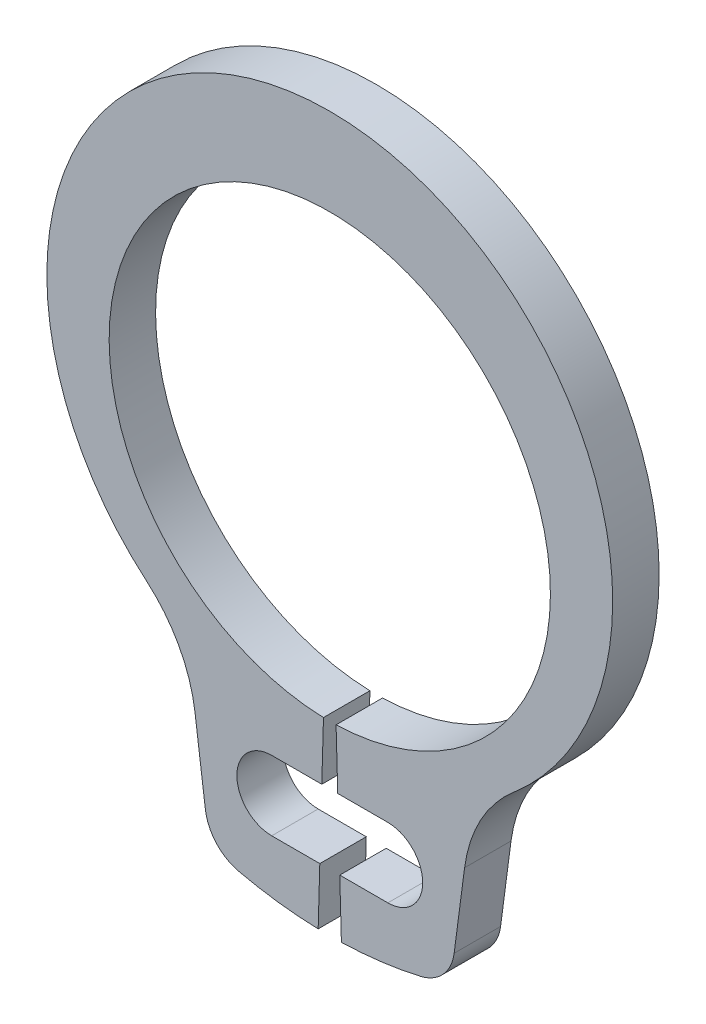
ISO-10303-21;
HEADER;
FILE_DESCRIPTION(('STEP AP214'),'2;1');
FILE_NAME('part.step','',(''),(''),'','','');
FILE_SCHEMA(('AUTOMOTIVE_DESIGN { 1 0 10303 214 1 1 1 1 }'));
ENDSEC;
DATA;
#1=APPLICATION_CONTEXT('core data for automotive mechanical design processes');
#2=APPLICATION_PROTOCOL_DEFINITION('international standard','automotive_design',2000,#1);
#3=PRODUCT_CONTEXT('',#1,'mechanical');
#4=PRODUCT('Part','Part','',(#3));
#5=PRODUCT_RELATED_PRODUCT_CATEGORY('part','',(#4));
#6=PRODUCT_DEFINITION_FORMATION('','',#4);
#7=PRODUCT_DEFINITION_CONTEXT('part definition',#1,'design');
#8=PRODUCT_DEFINITION('design','',#6,#7);
#9=PRODUCT_DEFINITION_SHAPE('','',#8);
#10=(LENGTH_UNIT() NAMED_UNIT(*) SI_UNIT(.MILLI.,.METRE.));
#11=(NAMED_UNIT(*) PLANE_ANGLE_UNIT() SI_UNIT($,.RADIAN.));
#12=(NAMED_UNIT(*) SI_UNIT($,.STERADIAN.) SOLID_ANGLE_UNIT());
#13=UNCERTAINTY_MEASURE_WITH_UNIT(LENGTH_MEASURE(1.E-05),#10,'distance_accuracy_value','');
#14=(GEOMETRIC_REPRESENTATION_CONTEXT(3) GLOBAL_UNCERTAINTY_ASSIGNED_CONTEXT((#13)) GLOBAL_UNIT_ASSIGNED_CONTEXT((#10,
#11,#12)) REPRESENTATION_CONTEXT('',''));
#15=CARTESIAN_POINT('',(0.,0.,0.));
#16=DIRECTION('',(0.,0.,1.));
#17=DIRECTION('',(1.,0.,0.));
#18=AXIS2_PLACEMENT_3D('',#15,#16,#17);
#19=CARTESIAN_POINT('',(-0.108571428571429,-3.7984486629278,-0.8));
#20=DIRECTION('',(0.999591753402051,-0.0285714285714286,0.));
#21=DIRECTION('',(0.0285714285714286,0.999591753402052,0.));
#22=AXIS2_PLACEMENT_3D('',#19,#20,#21);
#23=PLANE('',#22);
#24=DIRECTION('',(0.,0.,1.));
#25=VECTOR('',#24,1.);
#26=CARTESIAN_POINT('',(-0.13743687708596,-4.80832691319598,-0.8));
#27=LINE('',#26,#25);
#28=CARTESIAN_POINT('',(-0.13743687708596,-4.80832691319598,-0.8));
#29=VERTEX_POINT('',#28);
#30=CARTESIAN_POINT('',(-0.13743687708596,-4.80832691319598,0.));
#31=VERTEX_POINT('',#30);
#32=EDGE_CURVE('E204',#29,#31,#27,.T.);
#33=ORIENTED_EDGE('',*,*,#32,.F.);
#34=DIRECTION('',(0.0285714285714286,0.999591753402051,0.));
#35=VECTOR('',#34,1.);
#36=CARTESIAN_POINT('',(-0.108571428571429,-3.7984486629278,-0.8));
#37=LINE('',#36,#35);
#38=CARTESIAN_POINT('',(-0.108571428571429,-3.7984486629278,-0.8));
#39=VERTEX_POINT('',#38);
#40=EDGE_CURVE('E193',#29,#39,#37,.T.);
#41=ORIENTED_EDGE('',*,*,#40,.T.);
#42=DIRECTION('',(0.,0.,1.));
#43=VECTOR('',#42,1.);
#44=CARTESIAN_POINT('',(-0.108571428571429,-3.7984486629278,-0.8));
#45=LINE('',#44,#43);
#46=CARTESIAN_POINT('',(-0.108571428571429,-3.7984486629278,0.));
#47=VERTEX_POINT('',#46);
#48=EDGE_CURVE('E11',#39,#47,#45,.T.);
#49=ORIENTED_EDGE('',*,*,#48,.T.);
#50=DIRECTION('',(0.0285714285714286,0.999591753402051,0.));
#51=VECTOR('',#50,1.);
#52=CARTESIAN_POINT('',(-0.108571428571429,-3.7984486629278,0.));
#53=LINE('',#52,#51);
#54=EDGE_CURVE('E282',#31,#47,#53,.T.);
#55=ORIENTED_EDGE('',*,*,#54,.F.);
#56=EDGE_LOOP('',(#33,#41,#49,#55));
#57=FACE_BOUND('',#56,.T.);
#58=ADVANCED_FACE('F33',(#57),#23,.T.);
#59=CARTESIAN_POINT('',(0.108571428571429,-3.7984486629278,-0.8));
#60=DIRECTION('',(-0.999591753402051,-0.0285714285714286,0.));
#61=DIRECTION('',(0.0285714285714286,-0.999591753402052,0.));
#62=AXIS2_PLACEMENT_3D('',#59,#60,#61);
#63=PLANE('',#62);
#64=DIRECTION('',(0.,0.,-1.));
#65=VECTOR('',#64,1.);
#66=CARTESIAN_POINT('',(0.13743687708596,-4.80832691319598,-0.8));
#67=LINE('',#66,#65);
#68=CARTESIAN_POINT('',(0.13743687708596,-4.80832691319598,0.));
#69=VERTEX_POINT('',#68);
#70=CARTESIAN_POINT('',(0.13743687708596,-4.80832691319598,-0.8));
#71=VERTEX_POINT('',#70);
#72=EDGE_CURVE('E315',#69,#71,#67,.T.);
#73=ORIENTED_EDGE('',*,*,#72,.F.);
#74=DIRECTION('',(0.0285714285714286,-0.999591753402051,0.));
#75=VECTOR('',#74,1.);
#76=CARTESIAN_POINT('',(0.108571428571429,-3.7984486629278,0.));
#77=LINE('',#76,#75);
#78=CARTESIAN_POINT('',(0.108571428571429,-3.7984486629278,0.));
#79=VERTEX_POINT('',#78);
#80=EDGE_CURVE('E252',#79,#69,#77,.T.);
#81=ORIENTED_EDGE('',*,*,#80,.F.);
#82=DIRECTION('',(0.,0.,1.));
#83=VECTOR('',#82,1.);
#84=CARTESIAN_POINT('',(0.108571428571429,-3.7984486629278,-0.8));
#85=LINE('',#84,#83);
#86=CARTESIAN_POINT('',(0.108571428571429,-3.7984486629278,-0.8));
#87=VERTEX_POINT('',#86);
#88=EDGE_CURVE('E37',#87,#79,#85,.T.);
#89=ORIENTED_EDGE('',*,*,#88,.F.);
#90=DIRECTION('',(0.0285714285714286,-0.999591753402051,0.));
#91=VECTOR('',#90,1.);
#92=CARTESIAN_POINT('',(0.108571428571429,-3.7984486629278,-0.8));
#93=LINE('',#92,#91);
#94=EDGE_CURVE('E216',#87,#71,#93,.T.);
#95=ORIENTED_EDGE('',*,*,#94,.T.);
#96=EDGE_LOOP('',(#73,#81,#89,#95));
#97=FACE_BOUND('',#96,.T.);
#98=ADVANCED_FACE('F314',(#97),#63,.T.);
#99=CARTESIAN_POINT('',(0.,0.,-0.8));
#100=DIRECTION('',(0.,0.,1.));
#101=DIRECTION('',(1.,0.,0.));
#102=AXIS2_PLACEMENT_3D('',#99,#100,#101);
#103=CYLINDRICAL_SURFACE('',#102,3.8);
#104=CARTESIAN_POINT('',(0.,0.,0.));
#105=DIRECTION('',(0.,0.,-1.));
#106=DIRECTION('',(1.,0.,0.));
#107=AXIS2_PLACEMENT_3D('',#104,#105,#106);
#108=CIRCLE('',#107,3.8);
#109=EDGE_CURVE('E209',#47,#79,#108,.T.);
#110=ORIENTED_EDGE('',*,*,#109,.F.);
#111=ORIENTED_EDGE('',*,*,#48,.F.);
#112=CARTESIAN_POINT('',(0.,0.,-0.8));
#113=DIRECTION('',(0.,0.,-1.));
#114=DIRECTION('',(1.,0.,0.));
#115=AXIS2_PLACEMENT_3D('',#112,#113,#114);
#116=CIRCLE('',#115,3.8);
#117=EDGE_CURVE('E211',#39,#87,#116,.T.);
#118=ORIENTED_EDGE('',*,*,#117,.T.);
#119=ORIENTED_EDGE('',*,*,#88,.T.);
#120=EDGE_LOOP('',(#110,#111,#118,#119));
#121=FACE_BOUND('',#120,.T.);
#122=ADVANCED_FACE('F35',(#121),#103,.F.);
#123=DIRECTION('',(0.,0.,-1.));
#124=VECTOR('',#123,1.);
#125=CARTESIAN_POINT('',(-0.171736594114461,-6.00832691319598,-0.8));
#126=LINE('',#125,#124);
#127=CARTESIAN_POINT('',(-0.171736594114461,-6.00832691319598,0.));
#128=VERTEX_POINT('',#127);
#129=CARTESIAN_POINT('',(-0.171736594114461,-6.00832691319598,-0.8));
#130=VERTEX_POINT('',#129);
#131=EDGE_CURVE('E336',#128,#130,#126,.T.);
#132=ORIENTED_EDGE('',*,*,#131,.F.);
#133=CARTESIAN_POINT('',(-0.2,-6.99714227381436,0.));
#134=VERTEX_POINT('',#133);
#135=EDGE_CURVE('E215',#134,#128,#53,.T.);
#136=ORIENTED_EDGE('',*,*,#135,.F.);
#137=DIRECTION('',(0.,0.,1.));
#138=VECTOR('',#137,1.);
#139=CARTESIAN_POINT('',(-0.2,-6.99714227381436,-0.8));
#140=LINE('',#139,#138);
#141=CARTESIAN_POINT('',(-0.2,-6.99714227381436,-0.8));
#142=VERTEX_POINT('',#141);
#143=EDGE_CURVE('E42',#142,#134,#140,.T.);
#144=ORIENTED_EDGE('',*,*,#143,.F.);
#145=EDGE_CURVE('E246',#142,#130,#37,.T.);
#146=ORIENTED_EDGE('',*,*,#145,.T.);
#147=EDGE_LOOP('',(#132,#136,#144,#146));
#148=FACE_BOUND('',#147,.T.);
#149=ADVANCED_FACE('F384',(#148),#23,.T.);
#150=CARTESIAN_POINT('',(0.,0.,-0.8));
#151=DIRECTION('',(0.,0.,1.));
#152=DIRECTION('',(1.,0.,0.));
#153=AXIS2_PLACEMENT_3D('',#150,#151,#152);
#154=CYLINDRICAL_SURFACE('',#153,7.);
#155=CARTESIAN_POINT('',(0.,0.,0.));
#156=DIRECTION('',(0.,0.,1.));
#157=DIRECTION('',(1.,0.,0.));
#158=AXIS2_PLACEMENT_3D('',#155,#156,#157);
#159=CIRCLE('',#158,7.);
#160=CARTESIAN_POINT('',(-1.56620464709744,-6.82253640542946,0.));
#161=VERTEX_POINT('',#160);
#162=EDGE_CURVE('E279',#161,#134,#159,.T.);
#163=ORIENTED_EDGE('',*,*,#162,.F.);
#164=DIRECTION('',(0.,0.,1.));
#165=VECTOR('',#164,1.);
#166=CARTESIAN_POINT('',(-1.56620464709744,-6.82253640542946,-0.8));
#167=LINE('',#166,#165);
#168=CARTESIAN_POINT('',(-1.56620464709744,-6.82253640542946,-0.8));
#169=VERTEX_POINT('',#168);
#170=EDGE_CURVE('E286',#169,#161,#167,.T.);
#171=ORIENTED_EDGE('',*,*,#170,.F.);
#172=CARTESIAN_POINT('',(0.,0.,-0.8));
#173=DIRECTION('',(0.,0.,1.));
#174=DIRECTION('',(1.,0.,0.));
#175=AXIS2_PLACEMENT_3D('',#172,#173,#174);
#176=CIRCLE('',#175,7.);
#177=EDGE_CURVE('E243',#169,#142,#176,.T.);
#178=ORIENTED_EDGE('',*,*,#177,.T.);
#179=ORIENTED_EDGE('',*,*,#143,.T.);
#180=EDGE_LOOP('',(#163,#171,#178,#179));
#181=FACE_BOUND('',#180,.T.);
#182=ADVANCED_FACE('F380',(#181),#154,.T.);
#183=CARTESIAN_POINT('',(-1.398397006337,-6.09155036199059,-0.8));
#184=DIRECTION('',(0.,0.,1.));
#185=DIRECTION('',(1.,0.,0.));
#186=AXIS2_PLACEMENT_3D('',#183,#184,#185);
#187=CYLINDRICAL_SURFACE('',#186,0.75);
#188=CARTESIAN_POINT('',(-1.398397006337,-6.09155036199059,0.));
#189=DIRECTION('',(0.,0.,1.));
#190=DIRECTION('',(1.,0.,0.));
#191=AXIS2_PLACEMENT_3D('',#188,#189,#190);
#192=CIRCLE('',#191,0.75);
#193=CARTESIAN_POINT('',(-2.14198065236736,-6.18944500615563,0.));
#194=VERTEX_POINT('',#193);
#195=EDGE_CURVE('E276',#194,#161,#192,.T.);
#196=ORIENTED_EDGE('',*,*,#195,.F.);
#197=DIRECTION('',(0.,0.,1.));
#198=VECTOR('',#197,1.);
#199=CARTESIAN_POINT('',(-2.14198065236736,-6.18944500615563,-0.8));
#200=LINE('',#199,#198);
#201=CARTESIAN_POINT('',(-2.14198065236736,-6.18944500615563,-0.8));
#202=VERTEX_POINT('',#201);
#203=EDGE_CURVE('E288',#202,#194,#200,.T.);
#204=ORIENTED_EDGE('',*,*,#203,.F.);
#205=CARTESIAN_POINT('',(-1.398397006337,-6.09155036199059,-0.8));
#206=DIRECTION('',(0.,0.,1.));
#207=DIRECTION('',(1.,0.,0.));
#208=AXIS2_PLACEMENT_3D('',#205,#206,#207);
#209=CIRCLE('',#208,0.75);
#210=EDGE_CURVE('E240',#202,#169,#209,.T.);
#211=ORIENTED_EDGE('',*,*,#210,.T.);
#212=ORIENTED_EDGE('',*,*,#170,.T.);
#213=EDGE_LOOP('',(#196,#204,#211,#212));
#214=FACE_BOUND('',#213,.T.);
#215=ADVANCED_FACE('F376',(#214),#187,.T.);
#216=CARTESIAN_POINT('',(-2.32170777479744,-4.82428197678905,-0.8));
#217=DIRECTION('',(-0.99144486137381,-0.130526192220053,0.));
#218=DIRECTION('',(0.130526192220053,-0.99144486137381,0.));
#219=AXIS2_PLACEMENT_3D('',#216,#217,#218);
#220=PLANE('',#219);
#221=DIRECTION('',(0.130526192220053,-0.99144486137381,0.));
#222=VECTOR('',#221,1.);
#223=CARTESIAN_POINT('',(-2.32170777479744,-4.82428197678905,0.));
#224=LINE('',#223,#222);
#225=CARTESIAN_POINT('',(-2.32170777479744,-4.82428197678905,0.));
#226=VERTEX_POINT('',#225);
#227=EDGE_CURVE('E273',#226,#194,#224,.T.);
#228=ORIENTED_EDGE('',*,*,#227,.F.);
#229=DIRECTION('',(0.,0.,1.));
#230=VECTOR('',#229,1.);
#231=CARTESIAN_POINT('',(-2.32170777479744,-4.82428197678905,-0.8));
#232=LINE('',#231,#230);
#233=CARTESIAN_POINT('',(-2.32170777479744,-4.82428197678905,-0.8));
#234=VERTEX_POINT('',#233);
#235=EDGE_CURVE('E290',#234,#226,#232,.T.);
#236=ORIENTED_EDGE('',*,*,#235,.F.);
#237=DIRECTION('',(0.130526192220053,-0.99144486137381,0.));
#238=VECTOR('',#237,1.);
#239=CARTESIAN_POINT('',(-2.32170777479744,-4.82428197678905,-0.8));
#240=LINE('',#239,#238);
#241=EDGE_CURVE('E237',#234,#202,#240,.T.);
#242=ORIENTED_EDGE('',*,*,#241,.T.);
#243=ORIENTED_EDGE('',*,*,#203,.T.);
#244=EDGE_LOOP('',(#228,#236,#242,#243));
#245=FACE_BOUND('',#244,.T.);
#246=ADVANCED_FACE('F371',(#245),#220,.T.);
#247=CARTESIAN_POINT('',(-4.74788475146203,-5.14369423535598,-0.8));
#248=DIRECTION('',(0.,0.,1.));
#249=DIRECTION('',(1.,0.,0.));
#250=AXIS2_PLACEMENT_3D('',#247,#248,#249);
#251=CYLINDRICAL_SURFACE('',#250,2.4471123621567);
#252=CARTESIAN_POINT('',(-4.74788475146203,-5.14369423535598,0.));
#253=DIRECTION('',(0.,0.,-1.));
#254=DIRECTION('',(1.,0.,0.));
#255=AXIS2_PLACEMENT_3D('',#252,#253,#254);
#256=CIRCLE('',#255,2.4471123621567);
#257=CARTESIAN_POINT('',(-3.16059195252166,-3.28120652171807,0.));
#258=VERTEX_POINT('',#257);
#259=EDGE_CURVE('E270',#258,#226,#256,.T.);
#260=ORIENTED_EDGE('',*,*,#259,.F.);
#261=DIRECTION('',(0.,0.,1.));
#262=VECTOR('',#261,1.);
#263=CARTESIAN_POINT('',(-3.16059195252166,-3.28120652171807,-0.8));
#264=LINE('',#263,#262);
#265=CARTESIAN_POINT('',(-3.16059195252166,-3.28120652171807,-0.8));
#266=VERTEX_POINT('',#265);
#267=EDGE_CURVE('E292',#266,#258,#264,.T.);
#268=ORIENTED_EDGE('',*,*,#267,.F.);
#269=CARTESIAN_POINT('',(-4.74788475146203,-5.14369423535598,-0.8));
#270=DIRECTION('',(0.,0.,-1.));
#271=DIRECTION('',(1.,0.,0.));
#272=AXIS2_PLACEMENT_3D('',#269,#270,#271);
#273=CIRCLE('',#272,2.4471123621567);
#274=EDGE_CURVE('E234',#266,#234,#273,.T.);
#275=ORIENTED_EDGE('',*,*,#274,.T.);
#276=ORIENTED_EDGE('',*,*,#235,.T.);
#277=EDGE_LOOP('',(#260,#268,#275,#276));
#278=FACE_BOUND('',#277,.T.);
#279=ADVANCED_FACE('F367',(#278),#251,.F.);
#280=CARTESIAN_POINT('',(0.,0.427349129340247,-0.8));
#281=DIRECTION('',(0.,0.,1.));
#282=DIRECTION('',(1.,0.,0.));
#283=AXIS2_PLACEMENT_3D('',#280,#281,#282);
#284=CYLINDRICAL_SURFACE('',#283,4.87265087065975);
#285=CARTESIAN_POINT('',(0.,0.427349129340247,0.));
#286=DIRECTION('',(0.,0.,1.));
#287=DIRECTION('',(1.,0.,0.));
#288=AXIS2_PLACEMENT_3D('',#285,#286,#287);
#289=CIRCLE('',#288,4.87265087065975);
#290=CARTESIAN_POINT('',(3.16059195252166,-3.28120652171807,0.));
#291=VERTEX_POINT('',#290);
#292=EDGE_CURVE('E267',#291,#258,#289,.T.);
#293=ORIENTED_EDGE('',*,*,#292,.F.);
#294=DIRECTION('',(0.,0.,1.));
#295=VECTOR('',#294,1.);
#296=CARTESIAN_POINT('',(3.16059195252166,-3.28120652171807,-0.8));
#297=LINE('',#296,#295);
#298=CARTESIAN_POINT('',(3.16059195252166,-3.28120652171807,-0.8));
#299=VERTEX_POINT('',#298);
#300=EDGE_CURVE('E294',#299,#291,#297,.T.);
#301=ORIENTED_EDGE('',*,*,#300,.F.);
#302=CARTESIAN_POINT('',(0.,0.427349129340247,-0.8));
#303=DIRECTION('',(0.,0.,1.));
#304=DIRECTION('',(1.,0.,0.));
#305=AXIS2_PLACEMENT_3D('',#302,#303,#304);
#306=CIRCLE('',#305,4.87265087065975);
#307=EDGE_CURVE('E231',#299,#266,#306,.T.);
#308=ORIENTED_EDGE('',*,*,#307,.T.);
#309=ORIENTED_EDGE('',*,*,#267,.T.);
#310=EDGE_LOOP('',(#293,#301,#308,#309));
#311=FACE_BOUND('',#310,.T.);
#312=ADVANCED_FACE('F363',(#311),#284,.T.);
#313=CARTESIAN_POINT('',(4.74788475146203,-5.14369423535598,-0.8));
#314=DIRECTION('',(0.,0.,1.));
#315=DIRECTION('',(1.,0.,0.));
#316=AXIS2_PLACEMENT_3D('',#313,#314,#315);
#317=CYLINDRICAL_SURFACE('',#316,2.4471123621567);
#318=CARTESIAN_POINT('',(4.74788475146203,-5.14369423535598,0.));
#319=DIRECTION('',(0.,0.,-1.));
#320=DIRECTION('',(1.,0.,0.));
#321=AXIS2_PLACEMENT_3D('',#318,#319,#320);
#322=CIRCLE('',#321,2.4471123621567);
#323=CARTESIAN_POINT('',(2.32170777479744,-4.82428197678905,0.));
#324=VERTEX_POINT('',#323);
#325=EDGE_CURVE('E264',#324,#291,#322,.T.);
#326=ORIENTED_EDGE('',*,*,#325,.F.);
#327=DIRECTION('',(0.,0.,1.));
#328=VECTOR('',#327,1.);
#329=CARTESIAN_POINT('',(2.32170777479744,-4.82428197678905,-0.8));
#330=LINE('',#329,#328);
#331=CARTESIAN_POINT('',(2.32170777479744,-4.82428197678905,-0.8));
#332=VERTEX_POINT('',#331);
#333=EDGE_CURVE('E296',#332,#324,#330,.T.);
#334=ORIENTED_EDGE('',*,*,#333,.F.);
#335=CARTESIAN_POINT('',(4.74788475146203,-5.14369423535598,-0.8));
#336=DIRECTION('',(0.,0.,-1.));
#337=DIRECTION('',(1.,0.,0.));
#338=AXIS2_PLACEMENT_3D('',#335,#336,#337);
#339=CIRCLE('',#338,2.4471123621567);
#340=EDGE_CURVE('E228',#332,#299,#339,.T.);
#341=ORIENTED_EDGE('',*,*,#340,.T.);
#342=ORIENTED_EDGE('',*,*,#300,.T.);
#343=EDGE_LOOP('',(#326,#334,#341,#342));
#344=FACE_BOUND('',#343,.T.);
#345=ADVANCED_FACE('F359',(#344),#317,.F.);
#346=CARTESIAN_POINT('',(2.32170777479744,-4.82428197678905,-0.8));
#347=DIRECTION('',(0.99144486137381,-0.130526192220053,0.));
#348=DIRECTION('',(0.130526192220053,0.99144486137381,0.));
#349=AXIS2_PLACEMENT_3D('',#346,#347,#348);
#350=PLANE('',#349);
#351=DIRECTION('',(0.130526192220053,0.99144486137381,0.));
#352=VECTOR('',#351,1.);
#353=CARTESIAN_POINT('',(2.32170777479744,-4.82428197678905,0.));
#354=LINE('',#353,#352);
#355=CARTESIAN_POINT('',(2.14198065236736,-6.18944500615563,0.));
#356=VERTEX_POINT('',#355);
#357=EDGE_CURVE('E261',#356,#324,#354,.T.);
#358=ORIENTED_EDGE('',*,*,#357,.F.);
#359=DIRECTION('',(0.,0.,1.));
#360=VECTOR('',#359,1.);
#361=CARTESIAN_POINT('',(2.14198065236736,-6.18944500615563,-0.8));
#362=LINE('',#361,#360);
#363=CARTESIAN_POINT('',(2.14198065236736,-6.18944500615563,-0.8));
#364=VERTEX_POINT('',#363);
#365=EDGE_CURVE('E298',#364,#356,#362,.T.);
#366=ORIENTED_EDGE('',*,*,#365,.F.);
#367=DIRECTION('',(0.130526192220053,0.99144486137381,0.));
#368=VECTOR('',#367,1.);
#369=CARTESIAN_POINT('',(2.32170777479744,-4.82428197678905,-0.8));
#370=LINE('',#369,#368);
#371=EDGE_CURVE('E225',#364,#332,#370,.T.);
#372=ORIENTED_EDGE('',*,*,#371,.T.);
#373=ORIENTED_EDGE('',*,*,#333,.T.);
#374=EDGE_LOOP('',(#358,#366,#372,#373));
#375=FACE_BOUND('',#374,.T.);
#376=ADVANCED_FACE('F355',(#375),#350,.T.);
#377=CARTESIAN_POINT('',(1.398397006337,-6.09155036199059,-0.8));
#378=DIRECTION('',(0.,0.,1.));
#379=DIRECTION('',(1.,0.,0.));
#380=AXIS2_PLACEMENT_3D('',#377,#378,#379);
#381=CYLINDRICAL_SURFACE('',#380,0.75);
#382=CARTESIAN_POINT('',(1.398397006337,-6.09155036199059,0.));
#383=DIRECTION('',(0.,0.,1.));
#384=DIRECTION('',(-1.,0.,0.));
#385=AXIS2_PLACEMENT_3D('',#382,#383,#384);
#386=CIRCLE('',#385,0.75);
#387=CARTESIAN_POINT('',(1.56620464709744,-6.82253640542946,0.));
#388=VERTEX_POINT('',#387);
#389=EDGE_CURVE('E258',#388,#356,#386,.T.);
#390=ORIENTED_EDGE('',*,*,#389,.F.);
#391=DIRECTION('',(0.,0.,1.));
#392=VECTOR('',#391,1.);
#393=CARTESIAN_POINT('',(1.56620464709744,-6.82253640542946,-0.8));
#394=LINE('',#393,#392);
#395=CARTESIAN_POINT('',(1.56620464709744,-6.82253640542946,-0.8));
#396=VERTEX_POINT('',#395);
#397=EDGE_CURVE('E300',#396,#388,#394,.T.);
#398=ORIENTED_EDGE('',*,*,#397,.F.);
#399=CARTESIAN_POINT('',(1.398397006337,-6.09155036199059,-0.8));
#400=DIRECTION('',(0.,0.,1.));
#401=DIRECTION('',(-1.,0.,0.));
#402=AXIS2_PLACEMENT_3D('',#399,#400,#401);
#403=CIRCLE('',#402,0.75);
#404=EDGE_CURVE('E222',#396,#364,#403,.T.);
#405=ORIENTED_EDGE('',*,*,#404,.T.);
#406=ORIENTED_EDGE('',*,*,#365,.T.);
#407=EDGE_LOOP('',(#390,#398,#405,#406));
#408=FACE_BOUND('',#407,.T.);
#409=ADVANCED_FACE('F352',(#408),#381,.T.);
#410=CARTESIAN_POINT('',(0.,0.,-0.8));
#411=DIRECTION('',(0.,0.,1.));
#412=DIRECTION('',(1.,0.,0.));
#413=AXIS2_PLACEMENT_3D('',#410,#411,#412);
#414=CYLINDRICAL_SURFACE('',#413,7.);
#415=CARTESIAN_POINT('',(0.,0.,0.));
#416=DIRECTION('',(0.,0.,1.));
#417=DIRECTION('',(1.,0.,0.));
#418=AXIS2_PLACEMENT_3D('',#415,#416,#417);
#419=CIRCLE('',#418,7.);
#420=CARTESIAN_POINT('',(0.199999999999999,-6.99714227381436,0.));
#421=VERTEX_POINT('',#420);
#422=EDGE_CURVE('E255',#421,#388,#419,.T.);
#423=ORIENTED_EDGE('',*,*,#422,.F.);
#424=DIRECTION('',(0.,0.,1.));
#425=VECTOR('',#424,1.);
#426=CARTESIAN_POINT('',(0.199999999999999,-6.99714227381436,-0.8));
#427=LINE('',#426,#425);
#428=CARTESIAN_POINT('',(0.199999999999999,-6.99714227381436,-0.8));
#429=VERTEX_POINT('',#428);
#430=EDGE_CURVE('E301',#429,#421,#427,.T.);
#431=ORIENTED_EDGE('',*,*,#430,.F.);
#432=CARTESIAN_POINT('',(0.,0.,-0.8));
#433=DIRECTION('',(0.,0.,1.));
#434=DIRECTION('',(1.,0.,0.));
#435=AXIS2_PLACEMENT_3D('',#432,#433,#434);
#436=CIRCLE('',#435,7.);
#437=EDGE_CURVE('E219',#429,#396,#436,.T.);
#438=ORIENTED_EDGE('',*,*,#437,.T.);
#439=ORIENTED_EDGE('',*,*,#397,.T.);
#440=EDGE_LOOP('',(#423,#431,#438,#439));
#441=FACE_BOUND('',#440,.T.);
#442=ADVANCED_FACE('F348',(#441),#414,.T.);
#443=DIRECTION('',(0.,0.,1.));
#444=VECTOR('',#443,1.);
#445=CARTESIAN_POINT('',(0.171736594114461,-6.00832691319598,-0.8));
#446=LINE('',#445,#444);
#447=CARTESIAN_POINT('',(0.171736594114461,-6.00832691319598,-0.8));
#448=VERTEX_POINT('',#447);
#449=CARTESIAN_POINT('',(0.171736594114461,-6.00832691319598,0.));
#450=VERTEX_POINT('',#449);
#451=EDGE_CURVE('E331',#448,#450,#446,.T.);
#452=ORIENTED_EDGE('',*,*,#451,.F.);
#453=EDGE_CURVE('E214',#448,#429,#93,.T.);
#454=ORIENTED_EDGE('',*,*,#453,.T.);
#455=ORIENTED_EDGE('',*,*,#430,.T.);
#456=EDGE_CURVE('E251',#450,#421,#77,.T.);
#457=ORIENTED_EDGE('',*,*,#456,.F.);
#458=EDGE_LOOP('',(#452,#454,#455,#457));
#459=FACE_BOUND('',#458,.T.);
#460=ADVANCED_FACE('F346',(#459),#63,.T.);
#461=CARTESIAN_POINT('',(0.,0.,-0.8));
#462=DIRECTION('',(0.,0.,1.));
#463=DIRECTION('',(1.,0.,0.));
#464=AXIS2_PLACEMENT_3D('',#461,#462,#463);
#465=PLANE('',#464);
#466=CARTESIAN_POINT('',(1.,-5.40832691319598,-0.8));
#467=DIRECTION('',(0.,0.,1.));
#468=DIRECTION('',(1.,0.,0.));
#469=AXIS2_PLACEMENT_3D('',#466,#467,#468);
#470=CIRCLE('',#469,0.6);
#471=CARTESIAN_POINT('',(1.,-6.00832691319598,-0.8));
#472=VERTEX_POINT('',#471);
#473=CARTESIAN_POINT('',(1.,-4.80832691319598,-0.8));
#474=VERTEX_POINT('',#473);
#475=EDGE_CURVE('E202',#472,#474,#470,.T.);
#476=ORIENTED_EDGE('',*,*,#475,.T.);
#477=DIRECTION('',(-1.,0.,0.));
#478=VECTOR('',#477,1.);
#479=CARTESIAN_POINT('',(-1.,-4.80832691319598,-0.8));
#480=LINE('',#479,#478);
#481=EDGE_CURVE('E58',#474,#71,#480,.T.);
#482=ORIENTED_EDGE('',*,*,#481,.T.);
#483=ORIENTED_EDGE('',*,*,#94,.F.);
#484=ORIENTED_EDGE('',*,*,#117,.F.);
#485=ORIENTED_EDGE('',*,*,#40,.F.);
#486=CARTESIAN_POINT('',(-1.,-4.80832691319598,-0.8));
#487=VERTEX_POINT('',#486);
#488=EDGE_CURVE('E174',#29,#487,#480,.T.);
#489=ORIENTED_EDGE('',*,*,#488,.T.);
#490=CARTESIAN_POINT('',(-1.,-5.40832691319598,-0.8));
#491=DIRECTION('',(0.,0.,1.));
#492=DIRECTION('',(1.,0.,0.));
#493=AXIS2_PLACEMENT_3D('',#490,#491,#492);
#494=CIRCLE('',#493,0.6);
#495=CARTESIAN_POINT('',(-1.,-6.00832691319598,-0.8));
#496=VERTEX_POINT('',#495);
#497=EDGE_CURVE('E191',#487,#496,#494,.T.);
#498=ORIENTED_EDGE('',*,*,#497,.T.);
#499=DIRECTION('',(1.,0.,0.));
#500=VECTOR('',#499,1.);
#501=CARTESIAN_POINT('',(1.,-6.00832691319598,-0.8));
#502=LINE('',#501,#500);
#503=EDGE_CURVE('E183',#496,#130,#502,.T.);
#504=ORIENTED_EDGE('',*,*,#503,.T.);
#505=ORIENTED_EDGE('',*,*,#145,.F.);
#506=ORIENTED_EDGE('',*,*,#177,.F.);
#507=ORIENTED_EDGE('',*,*,#210,.F.);
#508=ORIENTED_EDGE('',*,*,#241,.F.);
#509=ORIENTED_EDGE('',*,*,#274,.F.);
#510=ORIENTED_EDGE('',*,*,#307,.F.);
#511=ORIENTED_EDGE('',*,*,#340,.F.);
#512=ORIENTED_EDGE('',*,*,#371,.F.);
#513=ORIENTED_EDGE('',*,*,#404,.F.);
#514=ORIENTED_EDGE('',*,*,#437,.F.);
#515=ORIENTED_EDGE('',*,*,#453,.F.);
#516=EDGE_CURVE('E323',#448,#472,#502,.T.);
#517=ORIENTED_EDGE('',*,*,#516,.T.);
#518=EDGE_LOOP('',(#476,#482,#483,#484,#485,#489,#498,#504,#505,#506,#507,#508,#509,#510,#511,
#512,#513,#514,#515,#517));
#519=FACE_BOUND('',#518,.T.);
#520=ADVANCED_FACE('F189',(#519),#465,.F.);
#521=CARTESIAN_POINT('',(0.,0.,0.));
#522=DIRECTION('',(0.,0.,1.));
#523=DIRECTION('',(1.,0.,0.));
#524=AXIS2_PLACEMENT_3D('',#521,#522,#523);
#525=PLANE('',#524);
#526=DIRECTION('',(-1.,0.,0.));
#527=VECTOR('',#526,1.);
#528=CARTESIAN_POINT('',(-1.,-4.80832691319598,0.));
#529=LINE('',#528,#527);
#530=CARTESIAN_POINT('',(1.,-4.80832691319598,0.));
#531=VERTEX_POINT('',#530);
#532=EDGE_CURVE('E326',#531,#69,#529,.T.);
#533=ORIENTED_EDGE('',*,*,#532,.F.);
#534=CARTESIAN_POINT('',(1.,-5.40832691319598,0.));
#535=DIRECTION('',(0.,0.,1.));
#536=DIRECTION('',(1.,0.,0.));
#537=AXIS2_PLACEMENT_3D('',#534,#535,#536);
#538=CIRCLE('',#537,0.6);
#539=CARTESIAN_POINT('',(1.,-6.00832691319598,0.));
#540=VERTEX_POINT('',#539);
#541=EDGE_CURVE('E198',#540,#531,#538,.T.);
#542=ORIENTED_EDGE('',*,*,#541,.F.);
#543=DIRECTION('',(1.,0.,0.));
#544=VECTOR('',#543,1.);
#545=CARTESIAN_POINT('',(1.,-6.00832691319598,0.));
#546=LINE('',#545,#544);
#547=EDGE_CURVE('E50',#450,#540,#546,.T.);
#548=ORIENTED_EDGE('',*,*,#547,.F.);
#549=ORIENTED_EDGE('',*,*,#456,.T.);
#550=ORIENTED_EDGE('',*,*,#422,.T.);
#551=ORIENTED_EDGE('',*,*,#389,.T.);
#552=ORIENTED_EDGE('',*,*,#357,.T.);
#553=ORIENTED_EDGE('',*,*,#325,.T.);
#554=ORIENTED_EDGE('',*,*,#292,.T.);
#555=ORIENTED_EDGE('',*,*,#259,.T.);
#556=ORIENTED_EDGE('',*,*,#227,.T.);
#557=ORIENTED_EDGE('',*,*,#195,.T.);
#558=ORIENTED_EDGE('',*,*,#162,.T.);
#559=ORIENTED_EDGE('',*,*,#135,.T.);
#560=CARTESIAN_POINT('',(-1.,-6.00832691319598,0.));
#561=VERTEX_POINT('',#560);
#562=EDGE_CURVE('E194',#561,#128,#546,.T.);
#563=ORIENTED_EDGE('',*,*,#562,.F.);
#564=CARTESIAN_POINT('',(-1.,-5.40832691319598,0.));
#565=DIRECTION('',(0.,0.,1.));
#566=DIRECTION('',(1.,0.,0.));
#567=AXIS2_PLACEMENT_3D('',#564,#565,#566);
#568=CIRCLE('',#567,0.6);
#569=CARTESIAN_POINT('',(-1.,-4.80832691319598,0.));
#570=VERTEX_POINT('',#569);
#571=EDGE_CURVE('E199',#570,#561,#568,.T.);
#572=ORIENTED_EDGE('',*,*,#571,.F.);
#573=EDGE_CURVE('E177',#31,#570,#529,.T.);
#574=ORIENTED_EDGE('',*,*,#573,.F.);
#575=ORIENTED_EDGE('',*,*,#54,.T.);
#576=ORIENTED_EDGE('',*,*,#109,.T.);
#577=ORIENTED_EDGE('',*,*,#80,.T.);
#578=EDGE_LOOP('',(#533,#542,#548,#549,#550,#551,#552,#553,#554,#555,#556,#557,#558,#559,#563,
#572,#574,#575,#576,#577));
#579=FACE_BOUND('',#578,.T.);
#580=ADVANCED_FACE('F318',(#579),#525,.T.);
#581=CARTESIAN_POINT('',(1.,-5.40832691319598,-0.8));
#582=DIRECTION('',(0.,0.,1.));
#583=DIRECTION('',(1.,0.,0.));
#584=AXIS2_PLACEMENT_3D('',#581,#582,#583);
#585=CYLINDRICAL_SURFACE('',#584,0.6);
#586=ORIENTED_EDGE('',*,*,#541,.T.);
#587=DIRECTION('',(0.,0.,1.));
#588=VECTOR('',#587,1.);
#589=CARTESIAN_POINT('',(1.,-4.80832691319598,-0.8));
#590=LINE('',#589,#588);
#591=EDGE_CURVE('E329',#474,#531,#590,.T.);
#592=ORIENTED_EDGE('',*,*,#591,.F.);
#593=ORIENTED_EDGE('',*,*,#475,.F.);
#594=DIRECTION('',(0.,0.,1.));
#595=VECTOR('',#594,1.);
#596=CARTESIAN_POINT('',(1.,-6.00832691319598,-0.8));
#597=LINE('',#596,#595);
#598=EDGE_CURVE('E332',#472,#540,#597,.T.);
#599=ORIENTED_EDGE('',*,*,#598,.T.);
#600=EDGE_LOOP('',(#586,#592,#593,#599));
#601=FACE_BOUND('',#600,.T.);
#602=ADVANCED_FACE('F340',(#601),#585,.F.);
#603=CARTESIAN_POINT('',(-1.,-5.40832691319598,-0.8));
#604=DIRECTION('',(0.,0.,1.));
#605=DIRECTION('',(1.,0.,0.));
#606=AXIS2_PLACEMENT_3D('',#603,#604,#605);
#607=CYLINDRICAL_SURFACE('',#606,0.6);
#608=ORIENTED_EDGE('',*,*,#571,.T.);
#609=DIRECTION('',(0.,0.,1.));
#610=VECTOR('',#609,1.);
#611=CARTESIAN_POINT('',(-1.,-6.00832691319598,-0.8));
#612=LINE('',#611,#610);
#613=EDGE_CURVE('E182',#496,#561,#612,.T.);
#614=ORIENTED_EDGE('',*,*,#613,.F.);
#615=ORIENTED_EDGE('',*,*,#497,.F.);
#616=DIRECTION('',(0.,0.,1.));
#617=VECTOR('',#616,1.);
#618=CARTESIAN_POINT('',(-1.,-4.80832691319598,-0.8));
#619=LINE('',#618,#617);
#620=EDGE_CURVE('E171',#487,#570,#619,.T.);
#621=ORIENTED_EDGE('',*,*,#620,.T.);
#622=EDGE_LOOP('',(#608,#614,#615,#621));
#623=FACE_BOUND('',#622,.T.);
#624=ADVANCED_FACE('F197',(#623),#607,.F.);
#625=CARTESIAN_POINT('',(-1.,-4.80832691319598,-0.8));
#626=DIRECTION('',(0.,1.,0.));
#627=DIRECTION('',(0.,0.,1.));
#628=AXIS2_PLACEMENT_3D('',#625,#626,#627);
#629=PLANE('',#628);
#630=ORIENTED_EDGE('',*,*,#32,.T.);
#631=ORIENTED_EDGE('',*,*,#573,.T.);
#632=ORIENTED_EDGE('',*,*,#620,.F.);
#633=ORIENTED_EDGE('',*,*,#488,.F.);
#634=EDGE_LOOP('',(#630,#631,#632,#633));
#635=FACE_BOUND('',#634,.T.);
#636=ADVANCED_FACE('F173',(#635),#629,.F.);
#637=CARTESIAN_POINT('',(1.,-6.00832691319598,-0.8));
#638=DIRECTION('',(0.,-1.,0.));
#639=DIRECTION('',(0.,0.,-1.));
#640=AXIS2_PLACEMENT_3D('',#637,#638,#639);
#641=PLANE('',#640);
#642=ORIENTED_EDGE('',*,*,#131,.T.);
#643=ORIENTED_EDGE('',*,*,#503,.F.);
#644=ORIENTED_EDGE('',*,*,#613,.T.);
#645=ORIENTED_EDGE('',*,*,#562,.T.);
#646=EDGE_LOOP('',(#642,#643,#644,#645));
#647=FACE_BOUND('',#646,.T.);
#648=ADVANCED_FACE('F387',(#647),#641,.F.);
#649=ORIENTED_EDGE('',*,*,#451,.T.);
#650=ORIENTED_EDGE('',*,*,#547,.T.);
#651=ORIENTED_EDGE('',*,*,#598,.F.);
#652=ORIENTED_EDGE('',*,*,#516,.F.);
#653=EDGE_LOOP('',(#649,#650,#651,#652));
#654=FACE_BOUND('',#653,.T.);
#655=ADVANCED_FACE('F341',(#654),#641,.F.);
#656=ORIENTED_EDGE('',*,*,#72,.T.);
#657=ORIENTED_EDGE('',*,*,#481,.F.);
#658=ORIENTED_EDGE('',*,*,#591,.T.);
#659=ORIENTED_EDGE('',*,*,#532,.T.);
#660=EDGE_LOOP('',(#656,#657,#658,#659));
#661=FACE_BOUND('',#660,.T.);
#662=ADVANCED_FACE('F337',(#661),#629,.F.);
#663=CLOSED_SHELL('',(#58,#98,#122,#149,#182,#215,#246,#279,#312,#345,#376,#409,#442,#460,#520,
#580,#602,#624,#636,#648,#655,#662));
#664=MANIFOLD_SOLID_BREP('B2',#663);
#665=ADVANCED_BREP_SHAPE_REPRESENTATION('',(#18,#664),#14);
#666=SHAPE_DEFINITION_REPRESENTATION(#9,#665);
ENDSEC;
END-ISO-10303-21;
